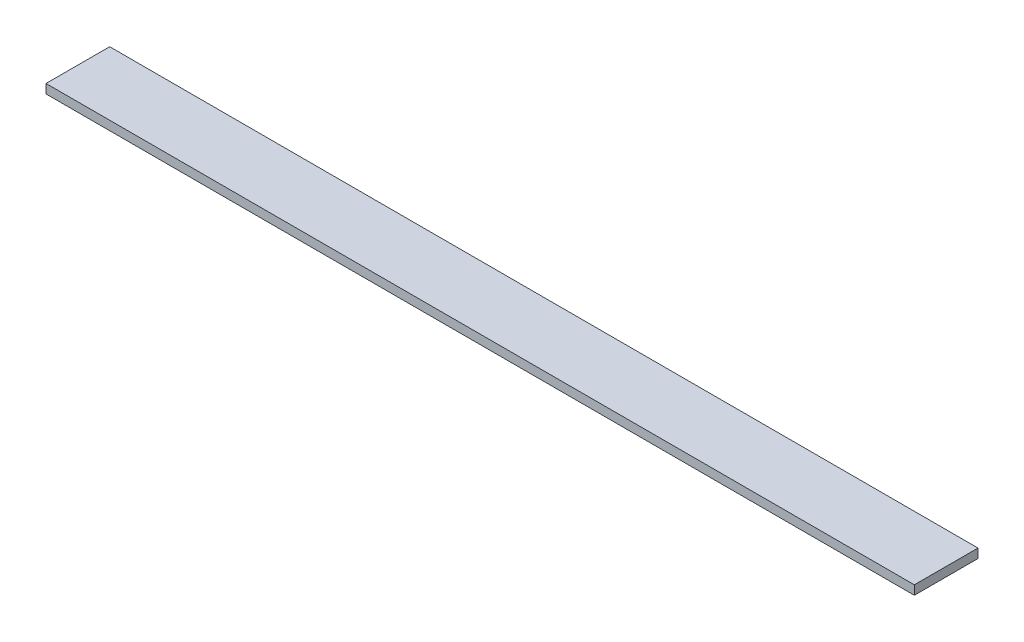
ISO-10303-21;
HEADER;
FILE_DESCRIPTION(('STEP AP214'),'2;1');
FILE_NAME('part.step','',(''),(''),'','','');
FILE_SCHEMA(('AUTOMOTIVE_DESIGN { 1 0 10303 214 1 1 1 1 }'));
ENDSEC;
DATA;
#1=APPLICATION_CONTEXT('core data for automotive mechanical design processes');
#2=APPLICATION_PROTOCOL_DEFINITION('international standard','automotive_design',2000,#1);
#3=PRODUCT_CONTEXT('',#1,'mechanical');
#4=PRODUCT('Part','Part','',(#3));
#5=PRODUCT_RELATED_PRODUCT_CATEGORY('part','',(#4));
#6=PRODUCT_DEFINITION_FORMATION('','',#4);
#7=PRODUCT_DEFINITION_CONTEXT('part definition',#1,'design');
#8=PRODUCT_DEFINITION('design','',#6,#7);
#9=PRODUCT_DEFINITION_SHAPE('','',#8);
#10=(LENGTH_UNIT() NAMED_UNIT(*) SI_UNIT(.MILLI.,.METRE.));
#11=(NAMED_UNIT(*) PLANE_ANGLE_UNIT() SI_UNIT($,.RADIAN.));
#12=(NAMED_UNIT(*) SI_UNIT($,.STERADIAN.) SOLID_ANGLE_UNIT());
#13=UNCERTAINTY_MEASURE_WITH_UNIT(LENGTH_MEASURE(1.E-05),#10,'distance_accuracy_value','');
#14=(GEOMETRIC_REPRESENTATION_CONTEXT(3) GLOBAL_UNCERTAINTY_ASSIGNED_CONTEXT((#13)) GLOBAL_UNIT_ASSIGNED_CONTEXT((#10,
#11,#12)) REPRESENTATION_CONTEXT('',''));
#15=CARTESIAN_POINT('',(0.,0.,0.));
#16=DIRECTION('',(0.,0.,1.));
#17=DIRECTION('',(1.,0.,0.));
#18=AXIS2_PLACEMENT_3D('',#15,#16,#17);
#19=CARTESIAN_POINT('',(0.,0.90678,0.));
#20=DIRECTION('',(1.,0.,0.));
#21=DIRECTION('',(0.,0.,-1.));
#22=AXIS2_PLACEMENT_3D('',#19,#20,#21);
#23=PLANE('',#22);
#24=DIRECTION('',(0.,0.,1.));
#25=VECTOR('',#24,1.);
#26=CARTESIAN_POINT('',(0.,0.,0.));
#27=LINE('',#26,#25);
#28=CARTESIAN_POINT('',(0.,0.,-6.35));
#29=VERTEX_POINT('',#28);
#30=CARTESIAN_POINT('',(0.,0.,0.));
#31=VERTEX_POINT('',#30);
#32=EDGE_CURVE('E107',#29,#31,#27,.T.);
#33=ORIENTED_EDGE('',*,*,#32,.T.);
#34=DIRECTION('',(0.,-1.,0.));
#35=VECTOR('',#34,1.);
#36=CARTESIAN_POINT('',(0.,0.90678,0.));
#37=LINE('',#36,#35);
#38=CARTESIAN_POINT('',(0.,0.90678,0.));
#39=VERTEX_POINT('',#38);
#40=EDGE_CURVE('E11',#39,#31,#37,.T.);
#41=ORIENTED_EDGE('',*,*,#40,.F.);
#42=DIRECTION('',(0.,0.,1.));
#43=VECTOR('',#42,1.);
#44=CARTESIAN_POINT('',(0.,0.90678,0.));
#45=LINE('',#44,#43);
#46=CARTESIAN_POINT('',(0.,0.90678,-6.35));
#47=VERTEX_POINT('',#46);
#48=EDGE_CURVE('E91',#47,#39,#45,.T.);
#49=ORIENTED_EDGE('',*,*,#48,.F.);
#50=DIRECTION('',(0.,-1.,0.));
#51=VECTOR('',#50,1.);
#52=CARTESIAN_POINT('',(0.,0.90678,-6.35));
#53=LINE('',#52,#51);
#54=EDGE_CURVE('E103',#47,#29,#53,.T.);
#55=ORIENTED_EDGE('',*,*,#54,.T.);
#56=EDGE_LOOP('',(#33,#41,#49,#55));
#57=FACE_BOUND('',#56,.T.);
#58=ADVANCED_FACE('F39',(#57),#23,.F.);
#59=CARTESIAN_POINT('',(0.,0.90678,0.));
#60=DIRECTION('',(0.,0.,-1.));
#61=DIRECTION('',(-1.,0.,0.));
#62=AXIS2_PLACEMENT_3D('',#59,#60,#61);
#63=PLANE('',#62);
#64=DIRECTION('',(1.,0.,0.));
#65=VECTOR('',#64,1.);
#66=CARTESIAN_POINT('',(0.,0.,0.));
#67=LINE('',#66,#65);
#68=CARTESIAN_POINT('',(86.614,0.,0.));
#69=VERTEX_POINT('',#68);
#70=EDGE_CURVE('E96',#31,#69,#67,.T.);
#71=ORIENTED_EDGE('',*,*,#70,.T.);
#72=DIRECTION('',(0.,-1.,0.));
#73=VECTOR('',#72,1.);
#74=CARTESIAN_POINT('',(86.614,0.90678,0.));
#75=LINE('',#74,#73);
#76=CARTESIAN_POINT('',(86.614,0.90678,0.));
#77=VERTEX_POINT('',#76);
#78=EDGE_CURVE('E48',#77,#69,#75,.T.);
#79=ORIENTED_EDGE('',*,*,#78,.F.);
#80=DIRECTION('',(1.,0.,0.));
#81=VECTOR('',#80,1.);
#82=CARTESIAN_POINT('',(0.,0.90678,0.));
#83=LINE('',#82,#81);
#84=EDGE_CURVE('E86',#39,#77,#83,.T.);
#85=ORIENTED_EDGE('',*,*,#84,.F.);
#86=ORIENTED_EDGE('',*,*,#40,.T.);
#87=EDGE_LOOP('',(#71,#79,#85,#86));
#88=FACE_BOUND('',#87,.T.);
#89=ADVANCED_FACE('F95',(#88),#63,.F.);
#90=CARTESIAN_POINT('',(86.614,0.90678,0.));
#91=DIRECTION('',(-1.,0.,0.));
#92=DIRECTION('',(0.,0.,1.));
#93=AXIS2_PLACEMENT_3D('',#90,#91,#92);
#94=PLANE('',#93);
#95=DIRECTION('',(0.,0.,-1.));
#96=VECTOR('',#95,1.);
#97=CARTESIAN_POINT('',(86.614,0.,0.));
#98=LINE('',#97,#96);
#99=CARTESIAN_POINT('',(86.614,0.,-6.35));
#100=VERTEX_POINT('',#99);
#101=EDGE_CURVE('E73',#69,#100,#98,.T.);
#102=ORIENTED_EDGE('',*,*,#101,.T.);
#103=DIRECTION('',(0.,-1.,0.));
#104=VECTOR('',#103,1.);
#105=CARTESIAN_POINT('',(86.614,0.90678,-6.35));
#106=LINE('',#105,#104);
#107=CARTESIAN_POINT('',(86.614,0.90678,-6.35));
#108=VERTEX_POINT('',#107);
#109=EDGE_CURVE('E98',#108,#100,#106,.T.);
#110=ORIENTED_EDGE('',*,*,#109,.F.);
#111=DIRECTION('',(0.,0.,-1.));
#112=VECTOR('',#111,1.);
#113=CARTESIAN_POINT('',(86.614,0.90678,0.));
#114=LINE('',#113,#112);
#115=EDGE_CURVE('E89',#77,#108,#114,.T.);
#116=ORIENTED_EDGE('',*,*,#115,.F.);
#117=ORIENTED_EDGE('',*,*,#78,.T.);
#118=EDGE_LOOP('',(#102,#110,#116,#117));
#119=FACE_BOUND('',#118,.T.);
#120=ADVANCED_FACE('F99',(#119),#94,.F.);
#121=CARTESIAN_POINT('',(0.,0.90678,-6.35));
#122=DIRECTION('',(0.,0.,1.));
#123=DIRECTION('',(1.,0.,0.));
#124=AXIS2_PLACEMENT_3D('',#121,#122,#123);
#125=PLANE('',#124);
#126=DIRECTION('',(-1.,0.,0.));
#127=VECTOR('',#126,1.);
#128=CARTESIAN_POINT('',(0.,0.,-6.35));
#129=LINE('',#128,#127);
#130=EDGE_CURVE('E79',#100,#29,#129,.T.);
#131=ORIENTED_EDGE('',*,*,#130,.T.);
#132=ORIENTED_EDGE('',*,*,#54,.F.);
#133=DIRECTION('',(-1.,0.,0.));
#134=VECTOR('',#133,1.);
#135=CARTESIAN_POINT('',(0.,0.90678,-6.35));
#136=LINE('',#135,#134);
#137=EDGE_CURVE('E56',#108,#47,#136,.T.);
#138=ORIENTED_EDGE('',*,*,#137,.F.);
#139=ORIENTED_EDGE('',*,*,#109,.T.);
#140=EDGE_LOOP('',(#131,#132,#138,#139));
#141=FACE_BOUND('',#140,.T.);
#142=ADVANCED_FACE('F120',(#141),#125,.F.);
#143=CARTESIAN_POINT('',(0.,0.90678,0.));
#144=DIRECTION('',(0.,-1.,0.));
#145=DIRECTION('',(0.,0.,-1.));
#146=AXIS2_PLACEMENT_3D('',#143,#144,#145);
#147=PLANE('',#146);
#148=ORIENTED_EDGE('',*,*,#48,.T.);
#149=ORIENTED_EDGE('',*,*,#84,.T.);
#150=ORIENTED_EDGE('',*,*,#115,.T.);
#151=ORIENTED_EDGE('',*,*,#137,.T.);
#152=EDGE_LOOP('',(#148,#149,#150,#151));
#153=FACE_BOUND('',#152,.T.);
#154=ADVANCED_FACE('F87',(#153),#147,.F.);
#155=CARTESIAN_POINT('',(0.,0.,0.));
#156=DIRECTION('',(0.,-1.,0.));
#157=DIRECTION('',(0.,0.,-1.));
#158=AXIS2_PLACEMENT_3D('',#155,#156,#157);
#159=PLANE('',#158);
#160=ORIENTED_EDGE('',*,*,#32,.F.);
#161=ORIENTED_EDGE('',*,*,#130,.F.);
#162=ORIENTED_EDGE('',*,*,#101,.F.);
#163=ORIENTED_EDGE('',*,*,#70,.F.);
#164=EDGE_LOOP('',(#160,#161,#162,#163));
#165=FACE_BOUND('',#164,.T.);
#166=ADVANCED_FACE('F123',(#165),#159,.T.);
#167=CLOSED_SHELL('',(#58,#89,#120,#142,#154,#166));
#168=MANIFOLD_SOLID_BREP('B2',#167);
#169=ADVANCED_BREP_SHAPE_REPRESENTATION('',(#18,#168),#14);
#170=SHAPE_DEFINITION_REPRESENTATION(#9,#169);
ENDSEC;
END-ISO-10303-21;
